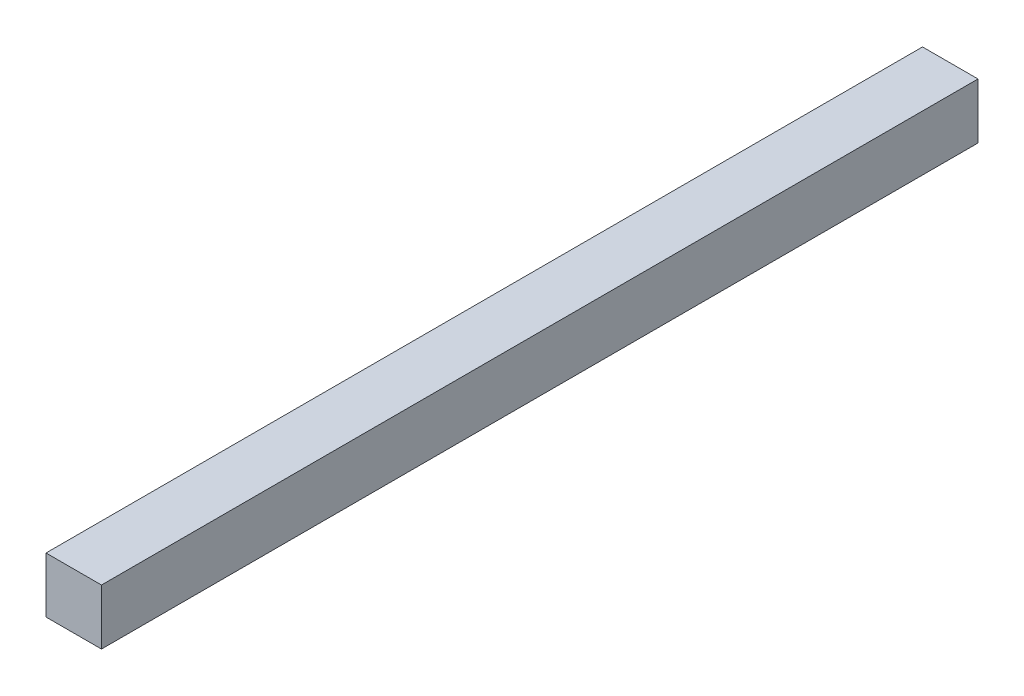
ISO-10303-21;
HEADER;
FILE_DESCRIPTION(('STEP AP214'),'2;1');
FILE_NAME('part.step','',(''),(''),'','','');
FILE_SCHEMA(('AUTOMOTIVE_DESIGN { 1 0 10303 214 1 1 1 1 }'));
ENDSEC;
DATA;
#1=APPLICATION_CONTEXT('core data for automotive mechanical design processes');
#2=APPLICATION_PROTOCOL_DEFINITION('international standard','automotive_design',2000,#1);
#3=PRODUCT_CONTEXT('',#1,'mechanical');
#4=PRODUCT('Part','Part','',(#3));
#5=PRODUCT_RELATED_PRODUCT_CATEGORY('part','',(#4));
#6=PRODUCT_DEFINITION_FORMATION('','',#4);
#7=PRODUCT_DEFINITION_CONTEXT('part definition',#1,'design');
#8=PRODUCT_DEFINITION('design','',#6,#7);
#9=PRODUCT_DEFINITION_SHAPE('','',#8);
#10=(LENGTH_UNIT() NAMED_UNIT(*) SI_UNIT(.MILLI.,.METRE.));
#11=(NAMED_UNIT(*) PLANE_ANGLE_UNIT() SI_UNIT($,.RADIAN.));
#12=(NAMED_UNIT(*) SI_UNIT($,.STERADIAN.) SOLID_ANGLE_UNIT());
#13=UNCERTAINTY_MEASURE_WITH_UNIT(LENGTH_MEASURE(1.E-05),#10,'distance_accuracy_value','');
#14=(GEOMETRIC_REPRESENTATION_CONTEXT(3) GLOBAL_UNCERTAINTY_ASSIGNED_CONTEXT((#13)) GLOBAL_UNIT_ASSIGNED_CONTEXT((#10,
#11,#12)) REPRESENTATION_CONTEXT('',''));
#15=CARTESIAN_POINT('',(0.,0.,0.));
#16=DIRECTION('',(0.,0.,1.));
#17=DIRECTION('',(1.,0.,0.));
#18=AXIS2_PLACEMENT_3D('',#15,#16,#17);
#19=CARTESIAN_POINT('',(0.,10.,0.));
#20=DIRECTION('',(1.,0.,0.));
#21=DIRECTION('',(0.,0.,-1.));
#22=AXIS2_PLACEMENT_3D('',#19,#20,#21);
#23=PLANE('',#22);
#24=DIRECTION('',(0.,0.,1.));
#25=VECTOR('',#24,1.);
#26=CARTESIAN_POINT('',(0.,0.,0.));
#27=LINE('',#26,#25);
#28=CARTESIAN_POINT('',(0.,0.,-158.));
#29=VERTEX_POINT('',#28);
#30=CARTESIAN_POINT('',(0.,0.,0.));
#31=VERTEX_POINT('',#30);
#32=EDGE_CURVE('E96',#29,#31,#27,.T.);
#33=ORIENTED_EDGE('',*,*,#32,.T.);
#34=DIRECTION('',(0.,-1.,0.));
#35=VECTOR('',#34,1.);
#36=CARTESIAN_POINT('',(0.,10.,0.));
#37=LINE('',#36,#35);
#38=CARTESIAN_POINT('',(0.,10.,0.));
#39=VERTEX_POINT('',#38);
#40=EDGE_CURVE('E11',#39,#31,#37,.T.);
#41=ORIENTED_EDGE('',*,*,#40,.F.);
#42=DIRECTION('',(0.,0.,1.));
#43=VECTOR('',#42,1.);
#44=CARTESIAN_POINT('',(0.,10.,0.));
#45=LINE('',#44,#43);
#46=CARTESIAN_POINT('',(0.,10.,-158.));
#47=VERTEX_POINT('',#46);
#48=EDGE_CURVE('E84',#47,#39,#45,.T.);
#49=ORIENTED_EDGE('',*,*,#48,.F.);
#50=DIRECTION('',(0.,-1.,0.));
#51=VECTOR('',#50,1.);
#52=CARTESIAN_POINT('',(0.,10.,-158.));
#53=LINE('',#52,#51);
#54=EDGE_CURVE('E92',#47,#29,#53,.T.);
#55=ORIENTED_EDGE('',*,*,#54,.T.);
#56=EDGE_LOOP('',(#33,#41,#49,#55));
#57=FACE_BOUND('',#56,.T.);
#58=ADVANCED_FACE('F33',(#57),#23,.F.);
#59=CARTESIAN_POINT('',(0.,10.,0.));
#60=DIRECTION('',(0.,0.,-1.));
#61=DIRECTION('',(-1.,0.,0.));
#62=AXIS2_PLACEMENT_3D('',#59,#60,#61);
#63=PLANE('',#62);
#64=DIRECTION('',(1.,0.,0.));
#65=VECTOR('',#64,1.);
#66=CARTESIAN_POINT('',(0.,0.,0.));
#67=LINE('',#66,#65);
#68=CARTESIAN_POINT('',(10.,0.,0.));
#69=VERTEX_POINT('',#68);
#70=EDGE_CURVE('E88',#31,#69,#67,.T.);
#71=ORIENTED_EDGE('',*,*,#70,.T.);
#72=DIRECTION('',(0.,-1.,0.));
#73=VECTOR('',#72,1.);
#74=CARTESIAN_POINT('',(10.,10.,0.));
#75=LINE('',#74,#73);
#76=CARTESIAN_POINT('',(10.,10.,0.));
#77=VERTEX_POINT('',#76);
#78=EDGE_CURVE('E41',#77,#69,#75,.T.);
#79=ORIENTED_EDGE('',*,*,#78,.F.);
#80=DIRECTION('',(1.,0.,0.));
#81=VECTOR('',#80,1.);
#82=CARTESIAN_POINT('',(0.,10.,0.));
#83=LINE('',#82,#81);
#84=EDGE_CURVE('E79',#39,#77,#83,.T.);
#85=ORIENTED_EDGE('',*,*,#84,.F.);
#86=ORIENTED_EDGE('',*,*,#40,.T.);
#87=EDGE_LOOP('',(#71,#79,#85,#86));
#88=FACE_BOUND('',#87,.T.);
#89=ADVANCED_FACE('F87',(#88),#63,.F.);
#90=CARTESIAN_POINT('',(10.,10.,0.));
#91=DIRECTION('',(-1.,0.,0.));
#92=DIRECTION('',(0.,0.,1.));
#93=AXIS2_PLACEMENT_3D('',#90,#91,#92);
#94=PLANE('',#93);
#95=DIRECTION('',(0.,0.,-1.));
#96=VECTOR('',#95,1.);
#97=CARTESIAN_POINT('',(10.,0.,0.));
#98=LINE('',#97,#96);
#99=CARTESIAN_POINT('',(10.,0.,-158.));
#100=VERTEX_POINT('',#99);
#101=EDGE_CURVE('E66',#69,#100,#98,.T.);
#102=ORIENTED_EDGE('',*,*,#101,.T.);
#103=DIRECTION('',(0.,-1.,0.));
#104=VECTOR('',#103,1.);
#105=CARTESIAN_POINT('',(10.,10.,-158.));
#106=LINE('',#105,#104);
#107=CARTESIAN_POINT('',(10.,10.,-158.));
#108=VERTEX_POINT('',#107);
#109=EDGE_CURVE('E89',#108,#100,#106,.T.);
#110=ORIENTED_EDGE('',*,*,#109,.F.);
#111=DIRECTION('',(0.,0.,-1.));
#112=VECTOR('',#111,1.);
#113=CARTESIAN_POINT('',(10.,10.,0.));
#114=LINE('',#113,#112);
#115=EDGE_CURVE('E82',#77,#108,#114,.T.);
#116=ORIENTED_EDGE('',*,*,#115,.F.);
#117=ORIENTED_EDGE('',*,*,#78,.T.);
#118=EDGE_LOOP('',(#102,#110,#116,#117));
#119=FACE_BOUND('',#118,.T.);
#120=ADVANCED_FACE('F90',(#119),#94,.F.);
#121=CARTESIAN_POINT('',(0.,10.,-158.));
#122=DIRECTION('',(0.,0.,1.));
#123=DIRECTION('',(1.,0.,0.));
#124=AXIS2_PLACEMENT_3D('',#121,#122,#123);
#125=PLANE('',#124);
#126=DIRECTION('',(-1.,0.,0.));
#127=VECTOR('',#126,1.);
#128=CARTESIAN_POINT('',(0.,0.,-158.));
#129=LINE('',#128,#127);
#130=EDGE_CURVE('E72',#100,#29,#129,.T.);
#131=ORIENTED_EDGE('',*,*,#130,.T.);
#132=ORIENTED_EDGE('',*,*,#54,.F.);
#133=DIRECTION('',(-1.,0.,0.));
#134=VECTOR('',#133,1.);
#135=CARTESIAN_POINT('',(0.,10.,-158.));
#136=LINE('',#135,#134);
#137=EDGE_CURVE('E49',#108,#47,#136,.T.);
#138=ORIENTED_EDGE('',*,*,#137,.F.);
#139=ORIENTED_EDGE('',*,*,#109,.T.);
#140=EDGE_LOOP('',(#131,#132,#138,#139));
#141=FACE_BOUND('',#140,.T.);
#142=ADVANCED_FACE('F103',(#141),#125,.F.);
#143=CARTESIAN_POINT('',(0.,10.,0.));
#144=DIRECTION('',(0.,-1.,0.));
#145=DIRECTION('',(0.,0.,-1.));
#146=AXIS2_PLACEMENT_3D('',#143,#144,#145);
#147=PLANE('',#146);
#148=ORIENTED_EDGE('',*,*,#48,.T.);
#149=ORIENTED_EDGE('',*,*,#84,.T.);
#150=ORIENTED_EDGE('',*,*,#115,.T.);
#151=ORIENTED_EDGE('',*,*,#137,.T.);
#152=EDGE_LOOP('',(#148,#149,#150,#151));
#153=FACE_BOUND('',#152,.T.);
#154=ADVANCED_FACE('F80',(#153),#147,.F.);
#155=CARTESIAN_POINT('',(0.,0.,0.));
#156=DIRECTION('',(0.,-1.,0.));
#157=DIRECTION('',(0.,0.,-1.));
#158=AXIS2_PLACEMENT_3D('',#155,#156,#157);
#159=PLANE('',#158);
#160=ORIENTED_EDGE('',*,*,#32,.F.);
#161=ORIENTED_EDGE('',*,*,#130,.F.);
#162=ORIENTED_EDGE('',*,*,#101,.F.);
#163=ORIENTED_EDGE('',*,*,#70,.F.);
#164=EDGE_LOOP('',(#160,#161,#162,#163));
#165=FACE_BOUND('',#164,.T.);
#166=ADVANCED_FACE('F106',(#165),#159,.T.);
#167=CLOSED_SHELL('',(#58,#89,#120,#142,#154,#166));
#168=MANIFOLD_SOLID_BREP('B2',#167);
#169=ADVANCED_BREP_SHAPE_REPRESENTATION('',(#18,#168),#14);
#170=SHAPE_DEFINITION_REPRESENTATION(#9,#169);
ENDSEC;
END-ISO-10303-21;
